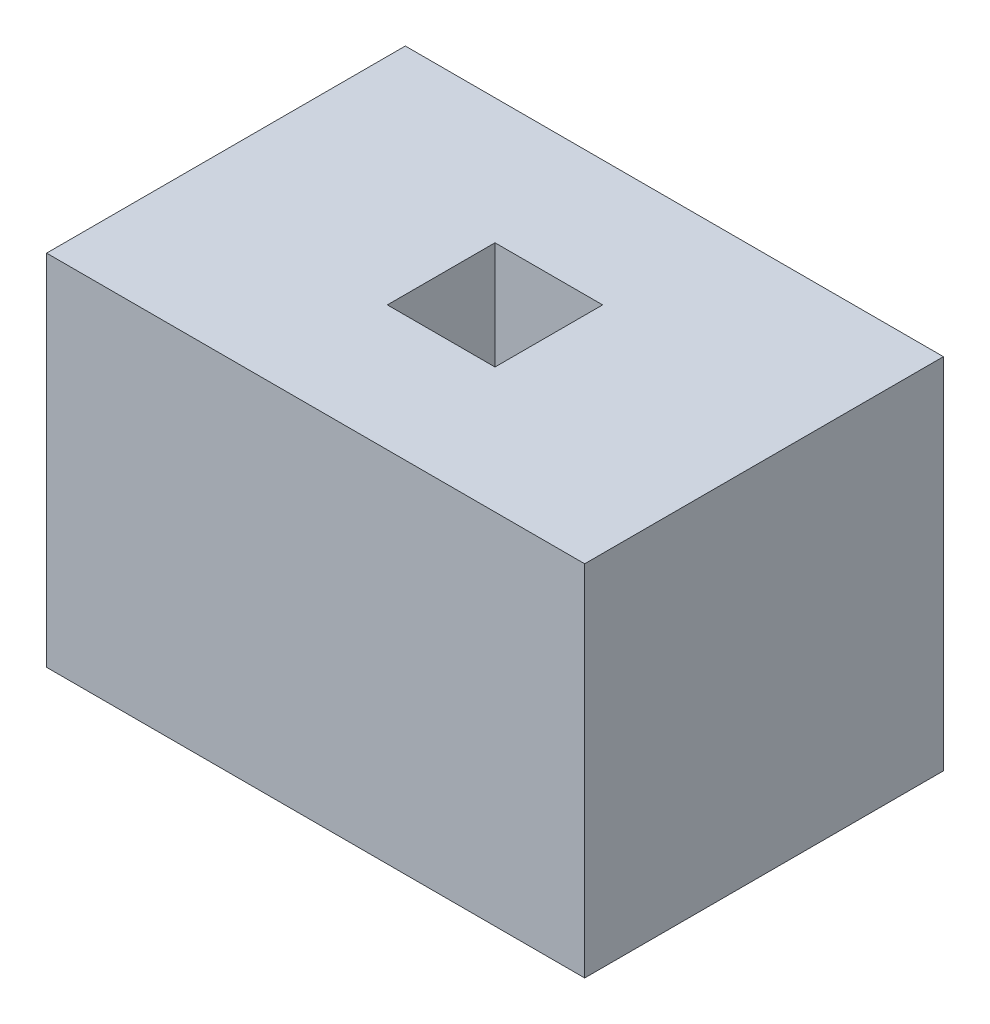
ISO-10303-21;
HEADER;
FILE_DESCRIPTION(('STEP AP214'),'2;1');
FILE_NAME('part.step','',(''),(''),'','','');
FILE_SCHEMA(('AUTOMOTIVE_DESIGN { 1 0 10303 214 1 1 1 1 }'));
ENDSEC;
DATA;
#1=APPLICATION_CONTEXT('core data for automotive mechanical design processes');
#2=APPLICATION_PROTOCOL_DEFINITION('international standard','automotive_design',2000,#1);
#3=PRODUCT_CONTEXT('',#1,'mechanical');
#4=PRODUCT('Part','Part','',(#3));
#5=PRODUCT_RELATED_PRODUCT_CATEGORY('part','',(#4));
#6=PRODUCT_DEFINITION_FORMATION('','',#4);
#7=PRODUCT_DEFINITION_CONTEXT('part definition',#1,'design');
#8=PRODUCT_DEFINITION('design','',#6,#7);
#9=PRODUCT_DEFINITION_SHAPE('','',#8);
#10=(LENGTH_UNIT() NAMED_UNIT(*) SI_UNIT(.MILLI.,.METRE.));
#11=(NAMED_UNIT(*) PLANE_ANGLE_UNIT() SI_UNIT($,.RADIAN.));
#12=(NAMED_UNIT(*) SI_UNIT($,.STERADIAN.) SOLID_ANGLE_UNIT());
#13=UNCERTAINTY_MEASURE_WITH_UNIT(LENGTH_MEASURE(1.E-05),#10,'distance_accuracy_value','');
#14=(GEOMETRIC_REPRESENTATION_CONTEXT(3) GLOBAL_UNCERTAINTY_ASSIGNED_CONTEXT((#13)) GLOBAL_UNIT_ASSIGNED_CONTEXT((#10,
#11,#12)) REPRESENTATION_CONTEXT('',''));
#15=CARTESIAN_POINT('',(0.,0.,0.));
#16=DIRECTION('',(0.,0.,1.));
#17=DIRECTION('',(1.,0.,0.));
#18=AXIS2_PLACEMENT_3D('',#15,#16,#17);
#19=CARTESIAN_POINT('',(1500.,2000.,1000.));
#20=DIRECTION('',(-1.,0.,0.));
#21=DIRECTION('',(0.,0.,1.));
#22=AXIS2_PLACEMENT_3D('',#19,#20,#21);
#23=PLANE('',#22);
#24=DIRECTION('',(0.,0.,-1.));
#25=VECTOR('',#24,1.);
#26=CARTESIAN_POINT('',(1500.,0.,1000.));
#27=LINE('',#26,#25);
#28=CARTESIAN_POINT('',(1500.,0.,1000.));
#29=VERTEX_POINT('',#28);
#30=CARTESIAN_POINT('',(1500.,0.,-1000.));
#31=VERTEX_POINT('',#30);
#32=EDGE_CURVE('E140',#29,#31,#27,.T.);
#33=ORIENTED_EDGE('',*,*,#32,.T.);
#34=DIRECTION('',(0.,-1.,0.));
#35=VECTOR('',#34,1.);
#36=CARTESIAN_POINT('',(1500.,2000.,-1000.));
#37=LINE('',#36,#35);
#38=CARTESIAN_POINT('',(1500.,2000.,-1000.));
#39=VERTEX_POINT('',#38);
#40=EDGE_CURVE('E11',#39,#31,#37,.T.);
#41=ORIENTED_EDGE('',*,*,#40,.F.);
#42=DIRECTION('',(0.,0.,-1.));
#43=VECTOR('',#42,1.);
#44=CARTESIAN_POINT('',(1500.,2000.,1000.));
#45=LINE('',#44,#43);
#46=CARTESIAN_POINT('',(1500.,2000.,1000.));
#47=VERTEX_POINT('',#46);
#48=EDGE_CURVE('E144',#47,#39,#45,.T.);
#49=ORIENTED_EDGE('',*,*,#48,.F.);
#50=DIRECTION('',(0.,-1.,0.));
#51=VECTOR('',#50,1.);
#52=CARTESIAN_POINT('',(1500.,2000.,1000.));
#53=LINE('',#52,#51);
#54=EDGE_CURVE('E150',#47,#29,#53,.T.);
#55=ORIENTED_EDGE('',*,*,#54,.T.);
#56=EDGE_LOOP('',(#33,#41,#49,#55));
#57=FACE_BOUND('',#56,.T.);
#58=ADVANCED_FACE('F32',(#57),#23,.F.);
#59=CARTESIAN_POINT('',(-1500.,2000.,-1000.));
#60=DIRECTION('',(0.,0.,1.));
#61=DIRECTION('',(1.,0.,0.));
#62=AXIS2_PLACEMENT_3D('',#59,#60,#61);
#63=PLANE('',#62);
#64=DIRECTION('',(-1.,0.,0.));
#65=VECTOR('',#64,1.);
#66=CARTESIAN_POINT('',(-1500.,0.,-1000.));
#67=LINE('',#66,#65);
#68=CARTESIAN_POINT('',(-1500.,0.,-1000.));
#69=VERTEX_POINT('',#68);
#70=EDGE_CURVE('E153',#31,#69,#67,.T.);
#71=ORIENTED_EDGE('',*,*,#70,.T.);
#72=DIRECTION('',(0.,-1.,0.));
#73=VECTOR('',#72,1.);
#74=CARTESIAN_POINT('',(-1500.,2000.,-1000.));
#75=LINE('',#74,#73);
#76=CARTESIAN_POINT('',(-1500.,2000.,-1000.));
#77=VERTEX_POINT('',#76);
#78=EDGE_CURVE('E39',#77,#69,#75,.T.);
#79=ORIENTED_EDGE('',*,*,#78,.F.);
#80=DIRECTION('',(-1.,0.,0.));
#81=VECTOR('',#80,1.);
#82=CARTESIAN_POINT('',(-1500.,2000.,-1000.));
#83=LINE('',#82,#81);
#84=EDGE_CURVE('E83',#39,#77,#83,.T.);
#85=ORIENTED_EDGE('',*,*,#84,.F.);
#86=ORIENTED_EDGE('',*,*,#40,.T.);
#87=EDGE_LOOP('',(#71,#79,#85,#86));
#88=FACE_BOUND('',#87,.T.);
#89=ADVANCED_FACE('F182',(#88),#63,.F.);
#90=CARTESIAN_POINT('',(-1500.,2000.,1000.));
#91=DIRECTION('',(1.,0.,0.));
#92=DIRECTION('',(0.,0.,-1.));
#93=AXIS2_PLACEMENT_3D('',#90,#91,#92);
#94=PLANE('',#93);
#95=DIRECTION('',(0.,0.,1.));
#96=VECTOR('',#95,1.);
#97=CARTESIAN_POINT('',(-1500.,0.,1000.));
#98=LINE('',#97,#96);
#99=CARTESIAN_POINT('',(-1500.,0.,1000.));
#100=VERTEX_POINT('',#99);
#101=EDGE_CURVE('E155',#69,#100,#98,.T.);
#102=ORIENTED_EDGE('',*,*,#101,.T.);
#103=DIRECTION('',(0.,-1.,0.));
#104=VECTOR('',#103,1.);
#105=CARTESIAN_POINT('',(-1500.,2000.,1000.));
#106=LINE('',#105,#104);
#107=CARTESIAN_POINT('',(-1500.,2000.,1000.));
#108=VERTEX_POINT('',#107);
#109=EDGE_CURVE('E159',#108,#100,#106,.T.);
#110=ORIENTED_EDGE('',*,*,#109,.F.);
#111=DIRECTION('',(0.,0.,1.));
#112=VECTOR('',#111,1.);
#113=CARTESIAN_POINT('',(-1500.,2000.,1000.));
#114=LINE('',#113,#112);
#115=EDGE_CURVE('E147',#77,#108,#114,.T.);
#116=ORIENTED_EDGE('',*,*,#115,.F.);
#117=ORIENTED_EDGE('',*,*,#78,.T.);
#118=EDGE_LOOP('',(#102,#110,#116,#117));
#119=FACE_BOUND('',#118,.T.);
#120=ADVANCED_FACE('F164',(#119),#94,.F.);
#121=CARTESIAN_POINT('',(-1500.,2000.,1000.));
#122=DIRECTION('',(0.,0.,-1.));
#123=DIRECTION('',(-1.,0.,0.));
#124=AXIS2_PLACEMENT_3D('',#121,#122,#123);
#125=PLANE('',#124);
#126=DIRECTION('',(1.,0.,0.));
#127=VECTOR('',#126,1.);
#128=CARTESIAN_POINT('',(-1500.,0.,1000.));
#129=LINE('',#128,#127);
#130=EDGE_CURVE('E76',#100,#29,#129,.T.);
#131=ORIENTED_EDGE('',*,*,#130,.T.);
#132=ORIENTED_EDGE('',*,*,#54,.F.);
#133=DIRECTION('',(1.,0.,0.));
#134=VECTOR('',#133,1.);
#135=CARTESIAN_POINT('',(-1500.,2000.,1000.));
#136=LINE('',#135,#134);
#137=EDGE_CURVE('E55',#108,#47,#136,.T.);
#138=ORIENTED_EDGE('',*,*,#137,.F.);
#139=ORIENTED_EDGE('',*,*,#109,.T.);
#140=EDGE_LOOP('',(#131,#132,#138,#139));
#141=FACE_BOUND('',#140,.T.);
#142=ADVANCED_FACE('F172',(#141),#125,.F.);
#143=CARTESIAN_POINT('',(0.,2000.,0.));
#144=DIRECTION('',(0.,-1.,0.));
#145=DIRECTION('',(0.,0.,-1.));
#146=AXIS2_PLACEMENT_3D('',#143,#144,#145);
#147=PLANE('',#146);
#148=DIRECTION('',(-1.,0.,0.));
#149=VECTOR('',#148,1.);
#150=CARTESIAN_POINT('',(-300.,2000.,-300.));
#151=LINE('',#150,#149);
#152=CARTESIAN_POINT('',(300.,2000.,-300.));
#153=VERTEX_POINT('',#152);
#154=CARTESIAN_POINT('',(-300.,2000.,-300.));
#155=VERTEX_POINT('',#154);
#156=EDGE_CURVE('E134',#153,#155,#151,.T.);
#157=ORIENTED_EDGE('',*,*,#156,.F.);
#158=DIRECTION('',(0.,0.,-1.));
#159=VECTOR('',#158,1.);
#160=CARTESIAN_POINT('',(300.,2000.,-300.));
#161=LINE('',#160,#159);
#162=CARTESIAN_POINT('',(300.,2000.,300.));
#163=VERTEX_POINT('',#162);
#164=EDGE_CURVE('E46',#163,#153,#161,.T.);
#165=ORIENTED_EDGE('',*,*,#164,.F.);
#166=DIRECTION('',(1.,0.,0.));
#167=VECTOR('',#166,1.);
#168=CARTESIAN_POINT('',(-300.,2000.,300.));
#169=LINE('',#168,#167);
#170=CARTESIAN_POINT('',(-300.,2000.,300.));
#171=VERTEX_POINT('',#170);
#172=EDGE_CURVE('E125',#171,#163,#169,.T.);
#173=ORIENTED_EDGE('',*,*,#172,.F.);
#174=DIRECTION('',(0.,0.,1.));
#175=VECTOR('',#174,1.);
#176=CARTESIAN_POINT('',(-300.,2000.,-300.));
#177=LINE('',#176,#175);
#178=EDGE_CURVE('E128',#155,#171,#177,.T.);
#179=ORIENTED_EDGE('',*,*,#178,.F.);
#180=EDGE_LOOP('',(#157,#165,#173,#179));
#181=FACE_BOUND('',#180,.T.);
#182=ORIENTED_EDGE('',*,*,#48,.T.);
#183=ORIENTED_EDGE('',*,*,#84,.T.);
#184=ORIENTED_EDGE('',*,*,#115,.T.);
#185=ORIENTED_EDGE('',*,*,#137,.T.);
#186=EDGE_LOOP('',(#182,#183,#184,#185));
#187=FACE_BOUND('',#186,.T.);
#188=ADVANCED_FACE('F174',(#181,#187),#147,.F.);
#189=CARTESIAN_POINT('',(0.,0.,0.));
#190=DIRECTION('',(0.,-1.,0.));
#191=DIRECTION('',(0.,0.,-1.));
#192=AXIS2_PLACEMENT_3D('',#189,#190,#191);
#193=PLANE('',#192);
#194=ORIENTED_EDGE('',*,*,#32,.F.);
#195=ORIENTED_EDGE('',*,*,#130,.F.);
#196=ORIENTED_EDGE('',*,*,#101,.F.);
#197=ORIENTED_EDGE('',*,*,#70,.F.);
#198=EDGE_LOOP('',(#194,#195,#196,#197));
#199=FACE_BOUND('',#198,.T.);
#200=ADVANCED_FACE('F168',(#199),#193,.T.);
#201=CARTESIAN_POINT('',(300.,1400.,-300.));
#202=DIRECTION('',(1.,0.,0.));
#203=DIRECTION('',(0.,0.,-1.));
#204=AXIS2_PLACEMENT_3D('',#201,#202,#203);
#205=PLANE('',#204);
#206=ORIENTED_EDGE('',*,*,#164,.T.);
#207=DIRECTION('',(0.,1.,0.));
#208=VECTOR('',#207,1.);
#209=CARTESIAN_POINT('',(300.,1400.,-300.));
#210=LINE('',#209,#208);
#211=CARTESIAN_POINT('',(300.,1400.,-300.));
#212=VERTEX_POINT('',#211);
#213=EDGE_CURVE('E103',#212,#153,#210,.T.);
#214=ORIENTED_EDGE('',*,*,#213,.F.);
#215=DIRECTION('',(0.,0.,-1.));
#216=VECTOR('',#215,1.);
#217=CARTESIAN_POINT('',(300.,1400.,-300.));
#218=LINE('',#217,#216);
#219=CARTESIAN_POINT('',(300.,1400.,300.));
#220=VERTEX_POINT('',#219);
#221=EDGE_CURVE('E107',#220,#212,#218,.T.);
#222=ORIENTED_EDGE('',*,*,#221,.F.);
#223=DIRECTION('',(0.,1.,0.));
#224=VECTOR('',#223,1.);
#225=CARTESIAN_POINT('',(300.,1400.,300.));
#226=LINE('',#225,#224);
#227=EDGE_CURVE('E138',#220,#163,#226,.T.);
#228=ORIENTED_EDGE('',*,*,#227,.T.);
#229=EDGE_LOOP('',(#206,#214,#222,#228));
#230=FACE_BOUND('',#229,.T.);
#231=ADVANCED_FACE('F105',(#230),#205,.F.);
#232=CARTESIAN_POINT('',(-300.,1400.,300.));
#233=DIRECTION('',(0.,0.,1.));
#234=DIRECTION('',(1.,0.,0.));
#235=AXIS2_PLACEMENT_3D('',#232,#233,#234);
#236=PLANE('',#235);
#237=ORIENTED_EDGE('',*,*,#172,.T.);
#238=ORIENTED_EDGE('',*,*,#227,.F.);
#239=DIRECTION('',(1.,0.,0.));
#240=VECTOR('',#239,1.);
#241=CARTESIAN_POINT('',(-300.,1400.,300.));
#242=LINE('',#241,#240);
#243=CARTESIAN_POINT('',(-300.,1400.,300.));
#244=VERTEX_POINT('',#243);
#245=EDGE_CURVE('E113',#244,#220,#242,.T.);
#246=ORIENTED_EDGE('',*,*,#245,.F.);
#247=DIRECTION('',(0.,1.,0.));
#248=VECTOR('',#247,1.);
#249=CARTESIAN_POINT('',(-300.,1400.,300.));
#250=LINE('',#249,#248);
#251=EDGE_CURVE('E141',#244,#171,#250,.T.);
#252=ORIENTED_EDGE('',*,*,#251,.T.);
#253=EDGE_LOOP('',(#237,#238,#246,#252));
#254=FACE_BOUND('',#253,.T.);
#255=ADVANCED_FACE('F221',(#254),#236,.F.);
#256=CARTESIAN_POINT('',(-300.,1400.,-300.));
#257=DIRECTION('',(-1.,0.,0.));
#258=DIRECTION('',(0.,0.,1.));
#259=AXIS2_PLACEMENT_3D('',#256,#257,#258);
#260=PLANE('',#259);
#261=ORIENTED_EDGE('',*,*,#178,.T.);
#262=ORIENTED_EDGE('',*,*,#251,.F.);
#263=DIRECTION('',(0.,0.,1.));
#264=VECTOR('',#263,1.);
#265=CARTESIAN_POINT('',(-300.,1400.,-300.));
#266=LINE('',#265,#264);
#267=CARTESIAN_POINT('',(-300.,1400.,-300.));
#268=VERTEX_POINT('',#267);
#269=EDGE_CURVE('E121',#268,#244,#266,.T.);
#270=ORIENTED_EDGE('',*,*,#269,.F.);
#271=DIRECTION('',(0.,1.,0.));
#272=VECTOR('',#271,1.);
#273=CARTESIAN_POINT('',(-300.,1400.,-300.));
#274=LINE('',#273,#272);
#275=EDGE_CURVE('E112',#268,#155,#274,.T.);
#276=ORIENTED_EDGE('',*,*,#275,.T.);
#277=EDGE_LOOP('',(#261,#262,#270,#276));
#278=FACE_BOUND('',#277,.T.);
#279=ADVANCED_FACE('F230',(#278),#260,.F.);
#280=CARTESIAN_POINT('',(-300.,1400.,-300.));
#281=DIRECTION('',(0.,0.,-1.));
#282=DIRECTION('',(-1.,0.,0.));
#283=AXIS2_PLACEMENT_3D('',#280,#281,#282);
#284=PLANE('',#283);
#285=ORIENTED_EDGE('',*,*,#156,.T.);
#286=ORIENTED_EDGE('',*,*,#275,.F.);
#287=DIRECTION('',(-1.,0.,0.));
#288=VECTOR('',#287,1.);
#289=CARTESIAN_POINT('',(-300.,1400.,-300.));
#290=LINE('',#289,#288);
#291=EDGE_CURVE('E116',#212,#268,#290,.T.);
#292=ORIENTED_EDGE('',*,*,#291,.F.);
#293=ORIENTED_EDGE('',*,*,#213,.T.);
#294=EDGE_LOOP('',(#285,#286,#292,#293));
#295=FACE_BOUND('',#294,.T.);
#296=ADVANCED_FACE('F117',(#295),#284,.F.);
#297=CARTESIAN_POINT('',(0.,1400.,0.));
#298=DIRECTION('',(0.,1.,0.));
#299=DIRECTION('',(0.,0.,1.));
#300=AXIS2_PLACEMENT_3D('',#297,#298,#299);
#301=PLANE('',#300);
#302=ORIENTED_EDGE('',*,*,#221,.T.);
#303=ORIENTED_EDGE('',*,*,#291,.T.);
#304=ORIENTED_EDGE('',*,*,#269,.T.);
#305=ORIENTED_EDGE('',*,*,#245,.T.);
#306=EDGE_LOOP('',(#302,#303,#304,#305));
#307=FACE_BOUND('',#306,.T.);
#308=ADVANCED_FACE('F123',(#307),#301,.T.);
#309=CLOSED_SHELL('',(#58,#89,#120,#142,#188,#200,#231,#255,#279,#296,#308));
#310=MANIFOLD_SOLID_BREP('B2',#309);
#311=ADVANCED_BREP_SHAPE_REPRESENTATION('',(#18,#310),#14);
#312=SHAPE_DEFINITION_REPRESENTATION(#9,#311);
ENDSEC;
END-ISO-10303-21;
